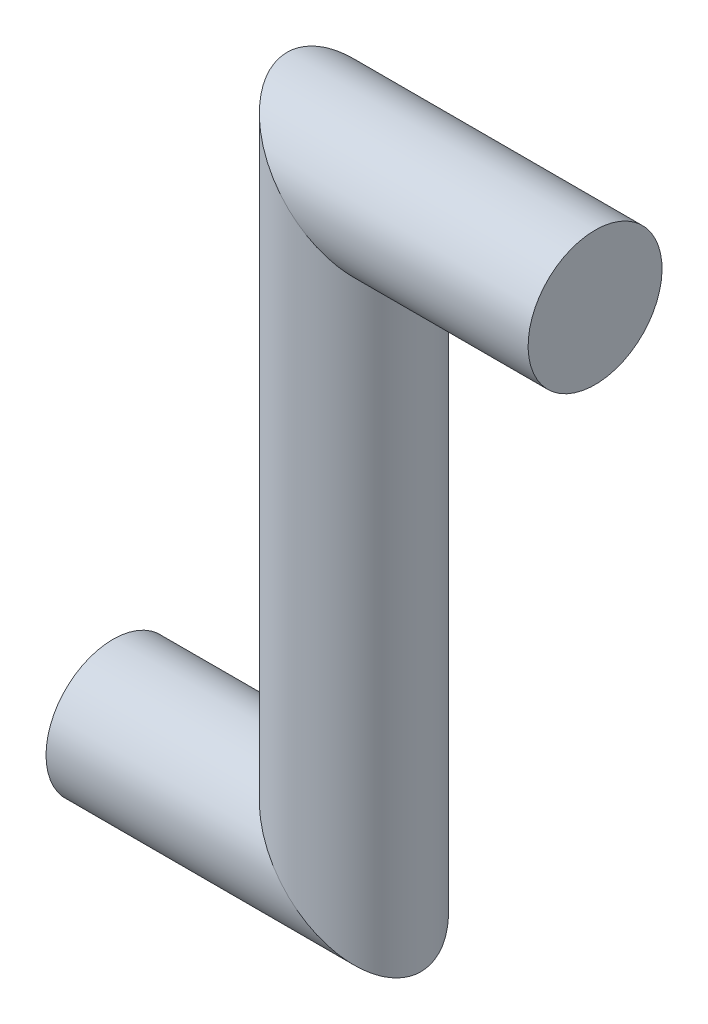
ISO-10303-21;
HEADER;
FILE_DESCRIPTION(('STEP AP214'),'2;1');
FILE_NAME('part.step','',(''),(''),'','','');
FILE_SCHEMA(('AUTOMOTIVE_DESIGN { 1 0 10303 214 1 1 1 1 }'));
ENDSEC;
DATA;
#1=APPLICATION_CONTEXT('core data for automotive mechanical design processes');
#2=APPLICATION_PROTOCOL_DEFINITION('international standard','automotive_design',2000,#1);
#3=PRODUCT_CONTEXT('',#1,'mechanical');
#4=PRODUCT('Part','Part','',(#3));
#5=PRODUCT_RELATED_PRODUCT_CATEGORY('part','',(#4));
#6=PRODUCT_DEFINITION_FORMATION('','',#4);
#7=PRODUCT_DEFINITION_CONTEXT('part definition',#1,'design');
#8=PRODUCT_DEFINITION('design','',#6,#7);
#9=PRODUCT_DEFINITION_SHAPE('','',#8);
#10=(LENGTH_UNIT() NAMED_UNIT(*) SI_UNIT(.MILLI.,.METRE.));
#11=(NAMED_UNIT(*) PLANE_ANGLE_UNIT() SI_UNIT($,.RADIAN.));
#12=(NAMED_UNIT(*) SI_UNIT($,.STERADIAN.) SOLID_ANGLE_UNIT());
#13=UNCERTAINTY_MEASURE_WITH_UNIT(LENGTH_MEASURE(1.E-05),#10,'distance_accuracy_value','');
#14=(GEOMETRIC_REPRESENTATION_CONTEXT(3) GLOBAL_UNCERTAINTY_ASSIGNED_CONTEXT((#13)) GLOBAL_UNIT_ASSIGNED_CONTEXT((#10,
#11,#12)) REPRESENTATION_CONTEXT('',''));
#15=CARTESIAN_POINT('',(0.,0.,0.));
#16=DIRECTION('',(0.,0.,1.));
#17=DIRECTION('',(1.,0.,0.));
#18=AXIS2_PLACEMENT_3D('',#15,#16,#17);
#19=CARTESIAN_POINT('',(-36.,-44.46,0.));
#20=DIRECTION('',(1.,0.,0.));
#21=DIRECTION('',(0.,1.,0.));
#22=AXIS2_PLACEMENT_3D('',#19,#20,#21);
#23=PLANE('',#22);
#24=CARTESIAN_POINT('',(-36.,-44.46,0.));
#25=DIRECTION('',(1.,0.,0.));
#26=DIRECTION('',(0.,1.,0.));
#27=AXIS2_PLACEMENT_3D('',#24,#25,#26);
#28=CIRCLE('',#27,5.);
#29=CARTESIAN_POINT('',(-36.,-39.46,0.));
#30=VERTEX_POINT('',#29);
#31=EDGE_CURVE('E48',#30,#30,#28,.T.);
#32=ORIENTED_EDGE('',*,*,#31,.F.);
#33=EDGE_LOOP('',(#32));
#34=FACE_BOUND('',#33,.T.);
#35=ADVANCED_FACE('F45',(#34),#23,.F.);
#36=CARTESIAN_POINT('',(0.,0.,0.));
#37=DIRECTION('',(1.,0.,0.));
#38=DIRECTION('',(0.,1.,0.));
#39=AXIS2_PLACEMENT_3D('',#36,#37,#38);
#40=PLANE('',#39);
#41=CARTESIAN_POINT('',(0.,0.,0.));
#42=DIRECTION('',(1.,0.,0.));
#43=DIRECTION('',(0.,1.,0.));
#44=AXIS2_PLACEMENT_3D('',#41,#42,#43);
#45=CIRCLE('',#44,5.);
#46=CARTESIAN_POINT('',(0.,5.00000000000003,0.));
#47=VERTEX_POINT('',#46);
#48=EDGE_CURVE('E54',#47,#47,#45,.T.);
#49=ORIENTED_EDGE('',*,*,#48,.T.);
#50=EDGE_LOOP('',(#49));
#51=FACE_BOUND('',#50,.T.);
#52=ADVANCED_FACE('F83',(#51),#40,.T.);
#53=CARTESIAN_POINT('',(-12.4,-44.46,0.));
#54=DIRECTION('',(-1.,0.,0.));
#55=DIRECTION('',(0.,-1.,0.));
#56=AXIS2_PLACEMENT_3D('',#53,#54,#55);
#57=CYLINDRICAL_SURFACE('',#56,5.);
#58=CARTESIAN_POINT('',(-18.,-44.46,0.));
#59=DIRECTION('',(-0.707106781186548,-0.707106781186547,0.));
#60=DIRECTION('',(0.707106781186547,-0.707106781186548,0.));
#61=AXIS2_PLACEMENT_3D('',#58,#59,#60);
#62=ELLIPSE('',#61,7.07106781186548,5.);
#63=CARTESIAN_POINT('',(-13.,-49.46,0.));
#64=VERTEX_POINT('',#63);
#65=EDGE_CURVE('E64',#64,#64,#62,.T.);
#66=ORIENTED_EDGE('',*,*,#65,.T.);
#67=EDGE_LOOP('',(#66));
#68=FACE_BOUND('',#67,.T.);
#69=ORIENTED_EDGE('',*,*,#31,.T.);
#70=EDGE_LOOP('',(#69));
#71=FACE_BOUND('',#70,.T.);
#72=ADVANCED_FACE('F75',(#68,#71),#57,.T.);
#73=CARTESIAN_POINT('',(-18.,5.59999999999999,0.));
#74=DIRECTION('',(0.,-1.,0.));
#75=DIRECTION('',(1.,0.,0.));
#76=AXIS2_PLACEMENT_3D('',#73,#74,#75);
#77=CYLINDRICAL_SURFACE('',#76,5.);
#78=CARTESIAN_POINT('',(-18.,0.,0.));
#79=DIRECTION('',(-0.707106781186547,-0.707106781186548,0.));
#80=DIRECTION('',(-0.707106781186548,0.707106781186547,0.));
#81=AXIS2_PLACEMENT_3D('',#78,#79,#80);
#82=ELLIPSE('',#81,7.07106781186547,5.);
#83=CARTESIAN_POINT('',(-23.,5.00000000000002,0.));
#84=VERTEX_POINT('',#83);
#85=EDGE_CURVE('E12',#84,#84,#82,.T.);
#86=ORIENTED_EDGE('',*,*,#85,.T.);
#87=EDGE_LOOP('',(#86));
#88=FACE_BOUND('',#87,.T.);
#89=ORIENTED_EDGE('',*,*,#65,.F.);
#90=EDGE_LOOP('',(#89));
#91=FACE_BOUND('',#90,.T.);
#92=ADVANCED_FACE('F73',(#88,#91),#77,.T.);
#93=CARTESIAN_POINT('',(0.,0.,0.));
#94=DIRECTION('',(-1.,0.,0.));
#95=DIRECTION('',(0.,-1.,0.));
#96=AXIS2_PLACEMENT_3D('',#93,#94,#95);
#97=CYLINDRICAL_SURFACE('',#96,5.);
#98=ORIENTED_EDGE('',*,*,#48,.F.);
#99=EDGE_LOOP('',(#98));
#100=FACE_BOUND('',#99,.T.);
#101=ORIENTED_EDGE('',*,*,#85,.F.);
#102=EDGE_LOOP('',(#101));
#103=FACE_BOUND('',#102,.T.);
#104=ADVANCED_FACE('F71',(#100,#103),#97,.T.);
#105=CLOSED_SHELL('',(#35,#52,#72,#92,#104));
#106=MANIFOLD_SOLID_BREP('B2',#105);
#107=ADVANCED_BREP_SHAPE_REPRESENTATION('',(#18,#106),#14);
#108=SHAPE_DEFINITION_REPRESENTATION(#9,#107);
ENDSEC;
END-ISO-10303-21;
